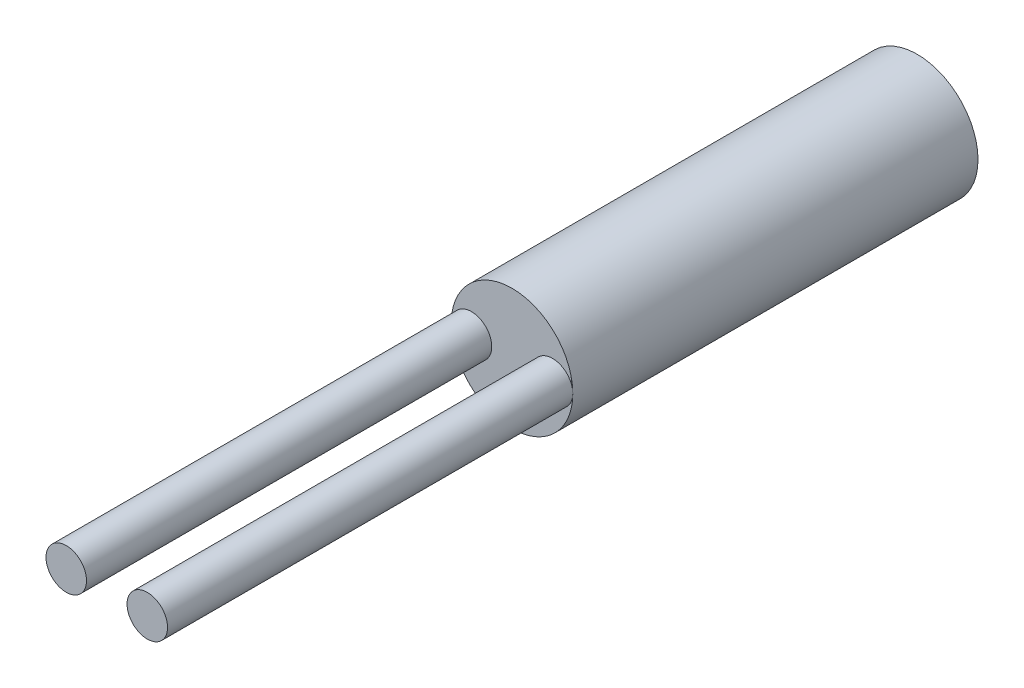
ISO-10303-21;
HEADER;
FILE_DESCRIPTION(('STEP AP214'),'2;1');
FILE_NAME('part.step','',(''),(''),'','','');
FILE_SCHEMA(('AUTOMOTIVE_DESIGN { 1 0 10303 214 1 1 1 1 }'));
ENDSEC;
DATA;
#1=APPLICATION_CONTEXT('core data for automotive mechanical design processes');
#2=APPLICATION_PROTOCOL_DEFINITION('international standard','automotive_design',2000,#1);
#3=PRODUCT_CONTEXT('',#1,'mechanical');
#4=PRODUCT('Part','Part','',(#3));
#5=PRODUCT_RELATED_PRODUCT_CATEGORY('part','',(#4));
#6=PRODUCT_DEFINITION_FORMATION('','',#4);
#7=PRODUCT_DEFINITION_CONTEXT('part definition',#1,'design');
#8=PRODUCT_DEFINITION('design','',#6,#7);
#9=PRODUCT_DEFINITION_SHAPE('','',#8);
#10=(LENGTH_UNIT() NAMED_UNIT(*) SI_UNIT(.MILLI.,.METRE.));
#11=(NAMED_UNIT(*) PLANE_ANGLE_UNIT() SI_UNIT($,.RADIAN.));
#12=(NAMED_UNIT(*) SI_UNIT($,.STERADIAN.) SOLID_ANGLE_UNIT());
#13=UNCERTAINTY_MEASURE_WITH_UNIT(LENGTH_MEASURE(1.E-05),#10,'distance_accuracy_value','');
#14=(GEOMETRIC_REPRESENTATION_CONTEXT(3) GLOBAL_UNCERTAINTY_ASSIGNED_CONTEXT((#13)) GLOBAL_UNIT_ASSIGNED_CONTEXT((#10,
#11,#12)) REPRESENTATION_CONTEXT('',''));
#15=CARTESIAN_POINT('',(0.,0.,0.));
#16=DIRECTION('',(0.,0.,1.));
#17=DIRECTION('',(1.,0.,0.));
#18=AXIS2_PLACEMENT_3D('',#15,#16,#17);
#19=CARTESIAN_POINT('',(0.,0.,20.));
#20=DIRECTION('',(0.,0.,-1.));
#21=DIRECTION('',(-1.,0.,0.));
#22=AXIS2_PLACEMENT_3D('',#19,#20,#21);
#23=CYLINDRICAL_SURFACE('',#22,3.);
#24=CARTESIAN_POINT('',(0.,0.,20.));
#25=DIRECTION('',(0.,0.,1.));
#26=DIRECTION('',(1.,0.,0.));
#27=AXIS2_PLACEMENT_3D('',#24,#25,#26);
#28=CIRCLE('',#27,3.);
#29=CARTESIAN_POINT('',(-3.,0.,20.));
#30=VERTEX_POINT('',#29);
#31=CARTESIAN_POINT('',(3.,0.,20.));
#32=VERTEX_POINT('',#31);
#33=EDGE_CURVE('E11',#30,#32,#28,.T.);
#34=ORIENTED_EDGE('',*,*,#33,.F.);
#35=EDGE_CURVE('E56',#32,#30,#28,.T.);
#36=ORIENTED_EDGE('',*,*,#35,.F.);
#37=EDGE_LOOP('',(#34,#36));
#38=FACE_BOUND('',#37,.T.);
#39=CARTESIAN_POINT('',(0.,0.,0.));
#40=DIRECTION('',(0.,0.,1.));
#41=DIRECTION('',(1.,0.,0.));
#42=AXIS2_PLACEMENT_3D('',#39,#40,#41);
#43=CIRCLE('',#42,3.);
#44=CARTESIAN_POINT('',(3.,0.,0.));
#45=VERTEX_POINT('',#44);
#46=EDGE_CURVE('E50',#45,#45,#43,.T.);
#47=ORIENTED_EDGE('',*,*,#46,.T.);
#48=EDGE_LOOP('',(#47));
#49=FACE_BOUND('',#48,.T.);
#50=ADVANCED_FACE('F47',(#38,#49),#23,.T.);
#51=CARTESIAN_POINT('',(0.,0.,20.));
#52=DIRECTION('',(0.,0.,1.));
#53=DIRECTION('',(1.,0.,0.));
#54=AXIS2_PLACEMENT_3D('',#51,#52,#53);
#55=PLANE('',#54);
#56=ORIENTED_EDGE('',*,*,#33,.T.);
#57=CARTESIAN_POINT('',(2.,0.,20.));
#58=DIRECTION('',(0.,0.,1.));
#59=DIRECTION('',(1.,0.,0.));
#60=AXIS2_PLACEMENT_3D('',#57,#58,#59);
#61=CIRCLE('',#60,1.);
#62=EDGE_CURVE('E61',#32,#32,#61,.T.);
#63=ORIENTED_EDGE('',*,*,#62,.F.);
#64=ORIENTED_EDGE('',*,*,#35,.T.);
#65=CARTESIAN_POINT('',(-2.,0.,20.));
#66=DIRECTION('',(0.,0.,1.));
#67=DIRECTION('',(1.,0.,0.));
#68=AXIS2_PLACEMENT_3D('',#65,#66,#67);
#69=CIRCLE('',#68,1.);
#70=EDGE_CURVE('E69',#30,#30,#69,.T.);
#71=ORIENTED_EDGE('',*,*,#70,.F.);
#72=EDGE_LOOP('',(#56,#63,#64,#71));
#73=FACE_BOUND('',#72,.T.);
#74=ADVANCED_FACE('F67',(#73),#55,.T.);
#75=CARTESIAN_POINT('',(0.,0.,0.));
#76=DIRECTION('',(0.,0.,1.));
#77=DIRECTION('',(1.,0.,0.));
#78=AXIS2_PLACEMENT_3D('',#75,#76,#77);
#79=PLANE('',#78);
#80=ORIENTED_EDGE('',*,*,#46,.F.);
#81=EDGE_LOOP('',(#80));
#82=FACE_BOUND('',#81,.T.);
#83=ADVANCED_FACE('F110',(#82),#79,.F.);
#84=CARTESIAN_POINT('',(-2.,0.,40.));
#85=DIRECTION('',(0.,0.,-1.));
#86=DIRECTION('',(-1.,0.,0.));
#87=AXIS2_PLACEMENT_3D('',#84,#85,#86);
#88=CYLINDRICAL_SURFACE('',#87,1.);
#89=CARTESIAN_POINT('',(-2.,0.,40.));
#90=DIRECTION('',(0.,0.,1.));
#91=DIRECTION('',(1.,0.,0.));
#92=AXIS2_PLACEMENT_3D('',#89,#90,#91);
#93=CIRCLE('',#92,1.);
#94=CARTESIAN_POINT('',(-1.,0.,40.));
#95=VERTEX_POINT('',#94);
#96=EDGE_CURVE('E78',#95,#95,#93,.T.);
#97=ORIENTED_EDGE('',*,*,#96,.F.);
#98=EDGE_LOOP('',(#97));
#99=FACE_BOUND('',#98,.T.);
#100=ORIENTED_EDGE('',*,*,#70,.T.);
#101=EDGE_LOOP('',(#100));
#102=FACE_BOUND('',#101,.T.);
#103=ADVANCED_FACE('F105',(#99,#102),#88,.T.);
#104=CARTESIAN_POINT('',(-2.,0.,40.));
#105=DIRECTION('',(0.,0.,1.));
#106=DIRECTION('',(1.,0.,0.));
#107=AXIS2_PLACEMENT_3D('',#104,#105,#106);
#108=PLANE('',#107);
#109=ORIENTED_EDGE('',*,*,#96,.T.);
#110=EDGE_LOOP('',(#109));
#111=FACE_BOUND('',#110,.T.);
#112=ADVANCED_FACE('F98',(#111),#108,.T.);
#113=CARTESIAN_POINT('',(2.,0.,40.));
#114=DIRECTION('',(0.,0.,-1.));
#115=DIRECTION('',(-1.,0.,0.));
#116=AXIS2_PLACEMENT_3D('',#113,#114,#115);
#117=CYLINDRICAL_SURFACE('',#116,1.);
#118=CARTESIAN_POINT('',(2.,0.,40.));
#119=DIRECTION('',(0.,0.,1.));
#120=DIRECTION('',(1.,0.,0.));
#121=AXIS2_PLACEMENT_3D('',#118,#119,#120);
#122=CIRCLE('',#121,1.);
#123=CARTESIAN_POINT('',(3.,0.,40.));
#124=VERTEX_POINT('',#123);
#125=EDGE_CURVE('E87',#124,#124,#122,.T.);
#126=ORIENTED_EDGE('',*,*,#125,.F.);
#127=EDGE_LOOP('',(#126));
#128=FACE_BOUND('',#127,.T.);
#129=ORIENTED_EDGE('',*,*,#62,.T.);
#130=EDGE_LOOP('',(#129));
#131=FACE_BOUND('',#130,.T.);
#132=ADVANCED_FACE('F96',(#128,#131),#117,.T.);
#133=CARTESIAN_POINT('',(2.,0.,40.));
#134=DIRECTION('',(0.,0.,1.));
#135=DIRECTION('',(1.,0.,0.));
#136=AXIS2_PLACEMENT_3D('',#133,#134,#135);
#137=PLANE('',#136);
#138=ORIENTED_EDGE('',*,*,#125,.T.);
#139=EDGE_LOOP('',(#138));
#140=FACE_BOUND('',#139,.T.);
#141=ADVANCED_FACE('F94',(#140),#137,.T.);
#142=CLOSED_SHELL('',(#50,#74,#83,#103,#112,#132,#141));
#143=MANIFOLD_SOLID_BREP('B2',#142);
#144=ADVANCED_BREP_SHAPE_REPRESENTATION('',(#18,#143),#14);
#145=SHAPE_DEFINITION_REPRESENTATION(#9,#144);
ENDSEC;
END-ISO-10303-21;
